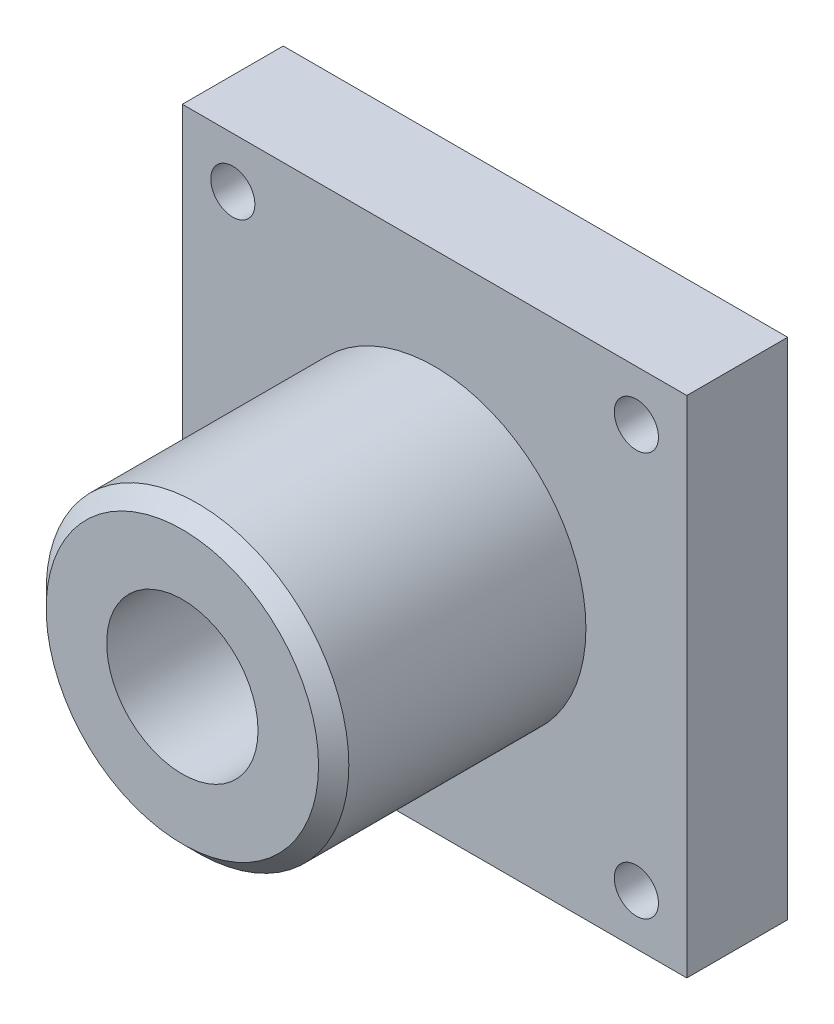
ISO-10303-21;
HEADER;
FILE_DESCRIPTION(('STEP AP214'),'2;1');
FILE_NAME('part.step','',(''),(''),'','','');
FILE_SCHEMA(('AUTOMOTIVE_DESIGN { 1 0 10303 214 1 1 1 1 }'));
ENDSEC;
DATA;
#1=APPLICATION_CONTEXT('core data for automotive mechanical design processes');
#2=APPLICATION_PROTOCOL_DEFINITION('international standard','automotive_design',2000,#1);
#3=PRODUCT_CONTEXT('',#1,'mechanical');
#4=PRODUCT('Part','Part','',(#3));
#5=PRODUCT_RELATED_PRODUCT_CATEGORY('part','',(#4));
#6=PRODUCT_DEFINITION_FORMATION('','',#4);
#7=PRODUCT_DEFINITION_CONTEXT('part definition',#1,'design');
#8=PRODUCT_DEFINITION('design','',#6,#7);
#9=PRODUCT_DEFINITION_SHAPE('','',#8);
#10=(LENGTH_UNIT() NAMED_UNIT(*) SI_UNIT(.MILLI.,.METRE.));
#11=(NAMED_UNIT(*) PLANE_ANGLE_UNIT() SI_UNIT($,.RADIAN.));
#12=(NAMED_UNIT(*) SI_UNIT($,.STERADIAN.) SOLID_ANGLE_UNIT());
#13=UNCERTAINTY_MEASURE_WITH_UNIT(LENGTH_MEASURE(1.E-05),#10,'distance_accuracy_value','');
#14=(GEOMETRIC_REPRESENTATION_CONTEXT(3) GLOBAL_UNCERTAINTY_ASSIGNED_CONTEXT((#13)) GLOBAL_UNIT_ASSIGNED_CONTEXT((#10,
#11,#12)) REPRESENTATION_CONTEXT('',''));
#15=CARTESIAN_POINT('',(0.,0.,0.));
#16=DIRECTION('',(0.,0.,1.));
#17=DIRECTION('',(1.,0.,0.));
#18=AXIS2_PLACEMENT_3D('',#15,#16,#17);
#19=CARTESIAN_POINT('',(127.,-127.,50.8));
#20=DIRECTION('',(0.,0.,1.));
#21=DIRECTION('',(1.,0.,0.));
#22=AXIS2_PLACEMENT_3D('',#19,#20,#21);
#23=PLANE('',#22);
#24=CARTESIAN_POINT('',(-101.6,101.6,50.8));
#25=DIRECTION('',(0.,0.,1.));
#26=DIRECTION('',(1.,0.,0.));
#27=AXIS2_PLACEMENT_3D('',#24,#25,#26);
#28=CIRCLE('',#27,11.1125);
#29=CARTESIAN_POINT('',(-90.4875,101.6,50.8));
#30=VERTEX_POINT('',#29);
#31=EDGE_CURVE('E271',#30,#30,#28,.T.);
#32=ORIENTED_EDGE('',*,*,#31,.F.);
#33=EDGE_LOOP('',(#32));
#34=FACE_BOUND('',#33,.T.);
#35=CARTESIAN_POINT('',(101.6,101.6,50.8));
#36=DIRECTION('',(0.,0.,1.));
#37=DIRECTION('',(1.,0.,0.));
#38=AXIS2_PLACEMENT_3D('',#35,#36,#37);
#39=CIRCLE('',#38,11.1125);
#40=CARTESIAN_POINT('',(112.7125,101.6,50.8));
#41=VERTEX_POINT('',#40);
#42=EDGE_CURVE('E273',#41,#41,#39,.T.);
#43=ORIENTED_EDGE('',*,*,#42,.F.);
#44=EDGE_LOOP('',(#43));
#45=FACE_BOUND('',#44,.T.);
#46=CARTESIAN_POINT('',(101.6,-101.6,50.8));
#47=DIRECTION('',(0.,0.,1.));
#48=DIRECTION('',(1.,0.,0.));
#49=AXIS2_PLACEMENT_3D('',#46,#47,#48);
#50=CIRCLE('',#49,11.1125);
#51=CARTESIAN_POINT('',(112.7125,-101.6,50.8));
#52=VERTEX_POINT('',#51);
#53=EDGE_CURVE('E281',#52,#52,#50,.T.);
#54=ORIENTED_EDGE('',*,*,#53,.F.);
#55=EDGE_LOOP('',(#54));
#56=FACE_BOUND('',#55,.T.);
#57=CARTESIAN_POINT('',(-101.6,-101.6,50.8));
#58=DIRECTION('',(0.,0.,1.));
#59=DIRECTION('',(1.,0.,0.));
#60=AXIS2_PLACEMENT_3D('',#57,#58,#59);
#61=CIRCLE('',#60,11.1125);
#62=CARTESIAN_POINT('',(-90.4875,-101.6,50.8));
#63=VERTEX_POINT('',#62);
#64=EDGE_CURVE('E287',#63,#63,#61,.T.);
#65=ORIENTED_EDGE('',*,*,#64,.F.);
#66=EDGE_LOOP('',(#65));
#67=FACE_BOUND('',#66,.T.);
#68=DIRECTION('',(0.,1.,0.));
#69=VECTOR('',#68,1.);
#70=CARTESIAN_POINT('',(127.,127.,50.8));
#71=LINE('',#70,#69);
#72=CARTESIAN_POINT('',(127.,-127.,50.8));
#73=VERTEX_POINT('',#72);
#74=CARTESIAN_POINT('',(127.,127.,50.8));
#75=VERTEX_POINT('',#74);
#76=EDGE_CURVE('E106',#73,#75,#71,.T.);
#77=ORIENTED_EDGE('',*,*,#76,.T.);
#78=DIRECTION('',(-1.,0.,0.));
#79=VECTOR('',#78,1.);
#80=CARTESIAN_POINT('',(-127.,127.,50.8));
#81=LINE('',#80,#79);
#82=CARTESIAN_POINT('',(-127.,127.,50.8));
#83=VERTEX_POINT('',#82);
#84=EDGE_CURVE('E101',#75,#83,#81,.T.);
#85=ORIENTED_EDGE('',*,*,#84,.T.);
#86=DIRECTION('',(0.,-1.,0.));
#87=VECTOR('',#86,1.);
#88=CARTESIAN_POINT('',(-127.,127.,50.8));
#89=LINE('',#88,#87);
#90=CARTESIAN_POINT('',(-127.,-127.,50.8));
#91=VERTEX_POINT('',#90);
#92=EDGE_CURVE('E104',#83,#91,#89,.T.);
#93=ORIENTED_EDGE('',*,*,#92,.T.);
#94=DIRECTION('',(1.,0.,0.));
#95=VECTOR('',#94,1.);
#96=CARTESIAN_POINT('',(-127.,-127.,50.8));
#97=LINE('',#96,#95);
#98=EDGE_CURVE('E70',#91,#73,#97,.T.);
#99=ORIENTED_EDGE('',*,*,#98,.T.);
#100=EDGE_LOOP('',(#77,#85,#93,#99));
#101=FACE_BOUND('',#100,.T.);
#102=CARTESIAN_POINT('',(0.,0.,50.8));
#103=DIRECTION('',(0.,0.,1.));
#104=DIRECTION('',(1.,0.,0.));
#105=AXIS2_PLACEMENT_3D('',#102,#103,#104);
#106=CIRCLE('',#105,76.2);
#107=CARTESIAN_POINT('',(76.2,0.,50.8));
#108=VERTEX_POINT('',#107);
#109=EDGE_CURVE('E124',#108,#108,#106,.T.);
#110=ORIENTED_EDGE('',*,*,#109,.F.);
#111=EDGE_LOOP('',(#110));
#112=FACE_BOUND('',#111,.T.);
#113=ADVANCED_FACE('F53',(#34,#45,#56,#67,#101,#112),#23,.T.);
#114=CARTESIAN_POINT('',(127.,127.,50.8));
#115=DIRECTION('',(-1.,0.,0.));
#116=DIRECTION('',(0.,-1.,0.));
#117=AXIS2_PLACEMENT_3D('',#114,#115,#116);
#118=PLANE('',#117);
#119=DIRECTION('',(0.,1.,0.));
#120=VECTOR('',#119,1.);
#121=CARTESIAN_POINT('',(127.,127.,0.));
#122=LINE('',#121,#120);
#123=CARTESIAN_POINT('',(127.,-127.,0.));
#124=VERTEX_POINT('',#123);
#125=CARTESIAN_POINT('',(127.,127.,0.));
#126=VERTEX_POINT('',#125);
#127=EDGE_CURVE('E121',#124,#126,#122,.T.);
#128=ORIENTED_EDGE('',*,*,#127,.T.);
#129=DIRECTION('',(0.,0.,-1.));
#130=VECTOR('',#129,1.);
#131=CARTESIAN_POINT('',(127.,127.,50.8));
#132=LINE('',#131,#130);
#133=EDGE_CURVE('E112',#75,#126,#132,.T.);
#134=ORIENTED_EDGE('',*,*,#133,.F.);
#135=ORIENTED_EDGE('',*,*,#76,.F.);
#136=DIRECTION('',(0.,0.,-1.));
#137=VECTOR('',#136,1.);
#138=CARTESIAN_POINT('',(127.,-127.,50.8));
#139=LINE('',#138,#137);
#140=EDGE_CURVE('E117',#73,#124,#139,.T.);
#141=ORIENTED_EDGE('',*,*,#140,.T.);
#142=EDGE_LOOP('',(#128,#134,#135,#141));
#143=FACE_BOUND('',#142,.T.);
#144=ADVANCED_FACE('F150',(#143),#118,.F.);
#145=CARTESIAN_POINT('',(-127.,127.,50.8));
#146=DIRECTION('',(0.,-1.,0.));
#147=DIRECTION('',(0.,0.,-1.));
#148=AXIS2_PLACEMENT_3D('',#145,#146,#147);
#149=PLANE('',#148);
#150=DIRECTION('',(-1.,0.,0.));
#151=VECTOR('',#150,1.);
#152=CARTESIAN_POINT('',(-127.,127.,0.));
#153=LINE('',#152,#151);
#154=CARTESIAN_POINT('',(-127.,127.,0.));
#155=VERTEX_POINT('',#154);
#156=EDGE_CURVE('E111',#126,#155,#153,.T.);
#157=ORIENTED_EDGE('',*,*,#156,.T.);
#158=DIRECTION('',(0.,0.,-1.));
#159=VECTOR('',#158,1.);
#160=CARTESIAN_POINT('',(-127.,127.,50.8));
#161=LINE('',#160,#159);
#162=EDGE_CURVE('E109',#83,#155,#161,.T.);
#163=ORIENTED_EDGE('',*,*,#162,.F.);
#164=ORIENTED_EDGE('',*,*,#84,.F.);
#165=ORIENTED_EDGE('',*,*,#133,.T.);
#166=EDGE_LOOP('',(#157,#163,#164,#165));
#167=FACE_BOUND('',#166,.T.);
#168=ADVANCED_FACE('F110',(#167),#149,.F.);
#169=CARTESIAN_POINT('',(-127.,127.,50.8));
#170=DIRECTION('',(1.,0.,0.));
#171=DIRECTION('',(0.,1.,0.));
#172=AXIS2_PLACEMENT_3D('',#169,#170,#171);
#173=PLANE('',#172);
#174=DIRECTION('',(0.,-1.,0.));
#175=VECTOR('',#174,1.);
#176=CARTESIAN_POINT('',(-127.,127.,0.));
#177=LINE('',#176,#175);
#178=CARTESIAN_POINT('',(-127.,-127.,0.));
#179=VERTEX_POINT('',#178);
#180=EDGE_CURVE('E87',#155,#179,#177,.T.);
#181=ORIENTED_EDGE('',*,*,#180,.T.);
#182=DIRECTION('',(0.,0.,-1.));
#183=VECTOR('',#182,1.);
#184=CARTESIAN_POINT('',(-127.,-127.,50.8));
#185=LINE('',#184,#183);
#186=EDGE_CURVE('E113',#91,#179,#185,.T.);
#187=ORIENTED_EDGE('',*,*,#186,.F.);
#188=ORIENTED_EDGE('',*,*,#92,.F.);
#189=ORIENTED_EDGE('',*,*,#162,.T.);
#190=EDGE_LOOP('',(#181,#187,#188,#189));
#191=FACE_BOUND('',#190,.T.);
#192=ADVANCED_FACE('F115',(#191),#173,.F.);
#193=CARTESIAN_POINT('',(-127.,-127.,50.8));
#194=DIRECTION('',(0.,1.,0.));
#195=DIRECTION('',(0.,0.,1.));
#196=AXIS2_PLACEMENT_3D('',#193,#194,#195);
#197=PLANE('',#196);
#198=DIRECTION('',(1.,0.,0.));
#199=VECTOR('',#198,1.);
#200=CARTESIAN_POINT('',(-127.,-127.,0.));
#201=LINE('',#200,#199);
#202=EDGE_CURVE('E93',#179,#124,#201,.T.);
#203=ORIENTED_EDGE('',*,*,#202,.T.);
#204=ORIENTED_EDGE('',*,*,#140,.F.);
#205=ORIENTED_EDGE('',*,*,#98,.F.);
#206=ORIENTED_EDGE('',*,*,#186,.T.);
#207=EDGE_LOOP('',(#203,#204,#205,#206));
#208=FACE_BOUND('',#207,.T.);
#209=ADVANCED_FACE('F164',(#208),#197,.F.);
#210=CARTESIAN_POINT('',(127.,-127.,0.));
#211=DIRECTION('',(0.,0.,1.));
#212=DIRECTION('',(1.,0.,0.));
#213=AXIS2_PLACEMENT_3D('',#210,#211,#212);
#214=PLANE('',#213);
#215=CARTESIAN_POINT('',(-101.6,101.6,0.));
#216=DIRECTION('',(0.,0.,1.));
#217=DIRECTION('',(1.,0.,0.));
#218=AXIS2_PLACEMENT_3D('',#215,#216,#217);
#219=CIRCLE('',#218,11.1125);
#220=CARTESIAN_POINT('',(-90.4875,101.6,0.));
#221=VERTEX_POINT('',#220);
#222=EDGE_CURVE('E269',#221,#221,#219,.T.);
#223=ORIENTED_EDGE('',*,*,#222,.T.);
#224=EDGE_LOOP('',(#223));
#225=FACE_BOUND('',#224,.T.);
#226=CARTESIAN_POINT('',(101.6,101.6,0.));
#227=DIRECTION('',(0.,0.,1.));
#228=DIRECTION('',(1.,0.,0.));
#229=AXIS2_PLACEMENT_3D('',#226,#227,#228);
#230=CIRCLE('',#229,11.1125);
#231=CARTESIAN_POINT('',(112.7125,101.6,0.));
#232=VERTEX_POINT('',#231);
#233=EDGE_CURVE('E278',#232,#232,#230,.T.);
#234=ORIENTED_EDGE('',*,*,#233,.T.);
#235=EDGE_LOOP('',(#234));
#236=FACE_BOUND('',#235,.T.);
#237=CARTESIAN_POINT('',(101.6,-101.6,0.));
#238=DIRECTION('',(0.,0.,1.));
#239=DIRECTION('',(1.,0.,0.));
#240=AXIS2_PLACEMENT_3D('',#237,#238,#239);
#241=CIRCLE('',#240,11.1125);
#242=CARTESIAN_POINT('',(112.7125,-101.6,0.));
#243=VERTEX_POINT('',#242);
#244=EDGE_CURVE('E284',#243,#243,#241,.T.);
#245=ORIENTED_EDGE('',*,*,#244,.T.);
#246=EDGE_LOOP('',(#245));
#247=FACE_BOUND('',#246,.T.);
#248=CARTESIAN_POINT('',(-101.6,-101.6,0.));
#249=DIRECTION('',(0.,0.,1.));
#250=DIRECTION('',(1.,0.,0.));
#251=AXIS2_PLACEMENT_3D('',#248,#249,#250);
#252=CIRCLE('',#251,11.1125);
#253=CARTESIAN_POINT('',(-90.4875,-101.6,0.));
#254=VERTEX_POINT('',#253);
#255=EDGE_CURVE('E290',#254,#254,#252,.T.);
#256=ORIENTED_EDGE('',*,*,#255,.T.);
#257=EDGE_LOOP('',(#256));
#258=FACE_BOUND('',#257,.T.);
#259=CARTESIAN_POINT('',(0.,0.,0.));
#260=DIRECTION('',(0.,0.,1.));
#261=DIRECTION('',(1.,0.,0.));
#262=AXIS2_PLACEMENT_3D('',#259,#260,#261);
#263=CIRCLE('',#262,38.1);
#264=CARTESIAN_POINT('',(38.1,0.,0.));
#265=VERTEX_POINT('',#264);
#266=EDGE_CURVE('E294',#265,#265,#263,.T.);
#267=ORIENTED_EDGE('',*,*,#266,.T.);
#268=EDGE_LOOP('',(#267));
#269=FACE_BOUND('',#268,.T.);
#270=ORIENTED_EDGE('',*,*,#127,.F.);
#271=ORIENTED_EDGE('',*,*,#202,.F.);
#272=ORIENTED_EDGE('',*,*,#180,.F.);
#273=ORIENTED_EDGE('',*,*,#156,.F.);
#274=EDGE_LOOP('',(#270,#271,#272,#273));
#275=FACE_BOUND('',#274,.T.);
#276=ADVANCED_FACE('F161',(#225,#236,#247,#258,#269,#275),#214,.F.);
#277=CARTESIAN_POINT('',(0.,0.,177.8));
#278=DIRECTION('',(0.,0.,-1.));
#279=DIRECTION('',(-1.,0.,0.));
#280=AXIS2_PLACEMENT_3D('',#277,#278,#279);
#281=CYLINDRICAL_SURFACE('',#280,76.2);
#282=CARTESIAN_POINT('',(0.,0.,170.18));
#283=DIRECTION('',(0.,0.,1.));
#284=DIRECTION('',(1.,0.,0.));
#285=AXIS2_PLACEMENT_3D('',#282,#283,#284);
#286=CIRCLE('',#285,76.2);
#287=CARTESIAN_POINT('',(76.2,0.,170.18));
#288=VERTEX_POINT('',#287);
#289=EDGE_CURVE('E13',#288,#288,#286,.F.);
#290=ORIENTED_EDGE('',*,*,#289,.T.);
#291=EDGE_LOOP('',(#290));
#292=FACE_BOUND('',#291,.T.);
#293=ORIENTED_EDGE('',*,*,#109,.T.);
#294=EDGE_LOOP('',(#293));
#295=FACE_BOUND('',#294,.T.);
#296=ADVANCED_FACE('F145',(#292,#295),#281,.T.);
#297=CARTESIAN_POINT('',(0.,0.,177.8));
#298=DIRECTION('',(0.,0.,1.));
#299=DIRECTION('',(1.,0.,0.));
#300=AXIS2_PLACEMENT_3D('',#297,#298,#299);
#301=PLANE('',#300);
#302=CARTESIAN_POINT('',(0.,0.,177.8));
#303=DIRECTION('',(0.,0.,1.));
#304=DIRECTION('',(1.,0.,0.));
#305=AXIS2_PLACEMENT_3D('',#302,#303,#304);
#306=CIRCLE('',#305,38.1);
#307=CARTESIAN_POINT('',(38.1,0.,177.8));
#308=VERTEX_POINT('',#307);
#309=EDGE_CURVE('E293',#308,#308,#306,.T.);
#310=ORIENTED_EDGE('',*,*,#309,.F.);
#311=EDGE_LOOP('',(#310));
#312=FACE_BOUND('',#311,.T.);
#313=CARTESIAN_POINT('',(0.,0.,177.8));
#314=DIRECTION('',(0.,0.,1.));
#315=DIRECTION('',(1.,0.,0.));
#316=AXIS2_PLACEMENT_3D('',#313,#314,#315);
#317=CIRCLE('',#316,68.5799999999999);
#318=CARTESIAN_POINT('',(68.5799999999999,0.,177.8));
#319=VERTEX_POINT('',#318);
#320=EDGE_CURVE('E62',#319,#319,#317,.T.);
#321=ORIENTED_EDGE('',*,*,#320,.T.);
#322=EDGE_LOOP('',(#321));
#323=FACE_BOUND('',#322,.T.);
#324=ADVANCED_FACE('F133',(#312,#323),#301,.T.);
#325=CARTESIAN_POINT('',(0.,0.,177.8));
#326=DIRECTION('',(0.,0.,-1.));
#327=DIRECTION('',(-1.,0.,0.));
#328=AXIS2_PLACEMENT_3D('',#325,#326,#327);
#329=CONICAL_SURFACE('',#328,68.5799999999999,0.785398163397451);
#330=ORIENTED_EDGE('',*,*,#289,.F.);
#331=EDGE_LOOP('',(#330));
#332=FACE_BOUND('',#331,.T.);
#333=ORIENTED_EDGE('',*,*,#320,.F.);
#334=EDGE_LOOP('',(#333));
#335=FACE_BOUND('',#334,.T.);
#336=ADVANCED_FACE('F55',(#332,#335),#329,.T.);
#337=CARTESIAN_POINT('',(0.,0.,0.));
#338=DIRECTION('',(0.,0.,1.));
#339=DIRECTION('',(1.,0.,0.));
#340=AXIS2_PLACEMENT_3D('',#337,#338,#339);
#341=CYLINDRICAL_SURFACE('',#340,38.1);
#342=ORIENTED_EDGE('',*,*,#266,.F.);
#343=EDGE_LOOP('',(#342));
#344=FACE_BOUND('',#343,.T.);
#345=ORIENTED_EDGE('',*,*,#309,.T.);
#346=EDGE_LOOP('',(#345));
#347=FACE_BOUND('',#346,.T.);
#348=ADVANCED_FACE('F136',(#344,#347),#341,.F.);
#349=CARTESIAN_POINT('',(-101.6,-101.6,50.8));
#350=DIRECTION('',(0.,0.,1.));
#351=DIRECTION('',(1.,0.,0.));
#352=AXIS2_PLACEMENT_3D('',#349,#350,#351);
#353=CYLINDRICAL_SURFACE('',#352,11.1125);
#354=ORIENTED_EDGE('',*,*,#255,.F.);
#355=EDGE_LOOP('',(#354));
#356=FACE_BOUND('',#355,.T.);
#357=ORIENTED_EDGE('',*,*,#64,.T.);
#358=EDGE_LOOP('',(#357));
#359=FACE_BOUND('',#358,.T.);
#360=ADVANCED_FACE('F142',(#356,#359),#353,.F.);
#361=CARTESIAN_POINT('',(101.6,-101.6,50.8));
#362=DIRECTION('',(0.,0.,1.));
#363=DIRECTION('',(1.,0.,0.));
#364=AXIS2_PLACEMENT_3D('',#361,#362,#363);
#365=CYLINDRICAL_SURFACE('',#364,11.1125);
#366=ORIENTED_EDGE('',*,*,#244,.F.);
#367=EDGE_LOOP('',(#366));
#368=FACE_BOUND('',#367,.T.);
#369=ORIENTED_EDGE('',*,*,#53,.T.);
#370=EDGE_LOOP('',(#369));
#371=FACE_BOUND('',#370,.T.);
#372=ADVANCED_FACE('F232',(#368,#371),#365,.F.);
#373=CARTESIAN_POINT('',(101.6,101.6,50.8));
#374=DIRECTION('',(0.,0.,1.));
#375=DIRECTION('',(1.,0.,0.));
#376=AXIS2_PLACEMENT_3D('',#373,#374,#375);
#377=CYLINDRICAL_SURFACE('',#376,11.1125);
#378=ORIENTED_EDGE('',*,*,#233,.F.);
#379=EDGE_LOOP('',(#378));
#380=FACE_BOUND('',#379,.T.);
#381=ORIENTED_EDGE('',*,*,#42,.T.);
#382=EDGE_LOOP('',(#381));
#383=FACE_BOUND('',#382,.T.);
#384=ADVANCED_FACE('F239',(#380,#383),#377,.F.);
#385=CARTESIAN_POINT('',(-101.6,101.6,50.8));
#386=DIRECTION('',(0.,0.,1.));
#387=DIRECTION('',(1.,0.,0.));
#388=AXIS2_PLACEMENT_3D('',#385,#386,#387);
#389=CYLINDRICAL_SURFACE('',#388,11.1125);
#390=ORIENTED_EDGE('',*,*,#222,.F.);
#391=EDGE_LOOP('',(#390));
#392=FACE_BOUND('',#391,.T.);
#393=ORIENTED_EDGE('',*,*,#31,.T.);
#394=EDGE_LOOP('',(#393));
#395=FACE_BOUND('',#394,.T.);
#396=ADVANCED_FACE('F247',(#392,#395),#389,.F.);
#397=CLOSED_SHELL('',(#113,#144,#168,#192,#209,#276,#296,#324,#336,#348,#360,#372,#384,#396));
#398=MANIFOLD_SOLID_BREP('B2',#397);
#399=ADVANCED_BREP_SHAPE_REPRESENTATION('',(#18,#398),#14);
#400=SHAPE_DEFINITION_REPRESENTATION(#9,#399);
ENDSEC;
END-ISO-10303-21;
